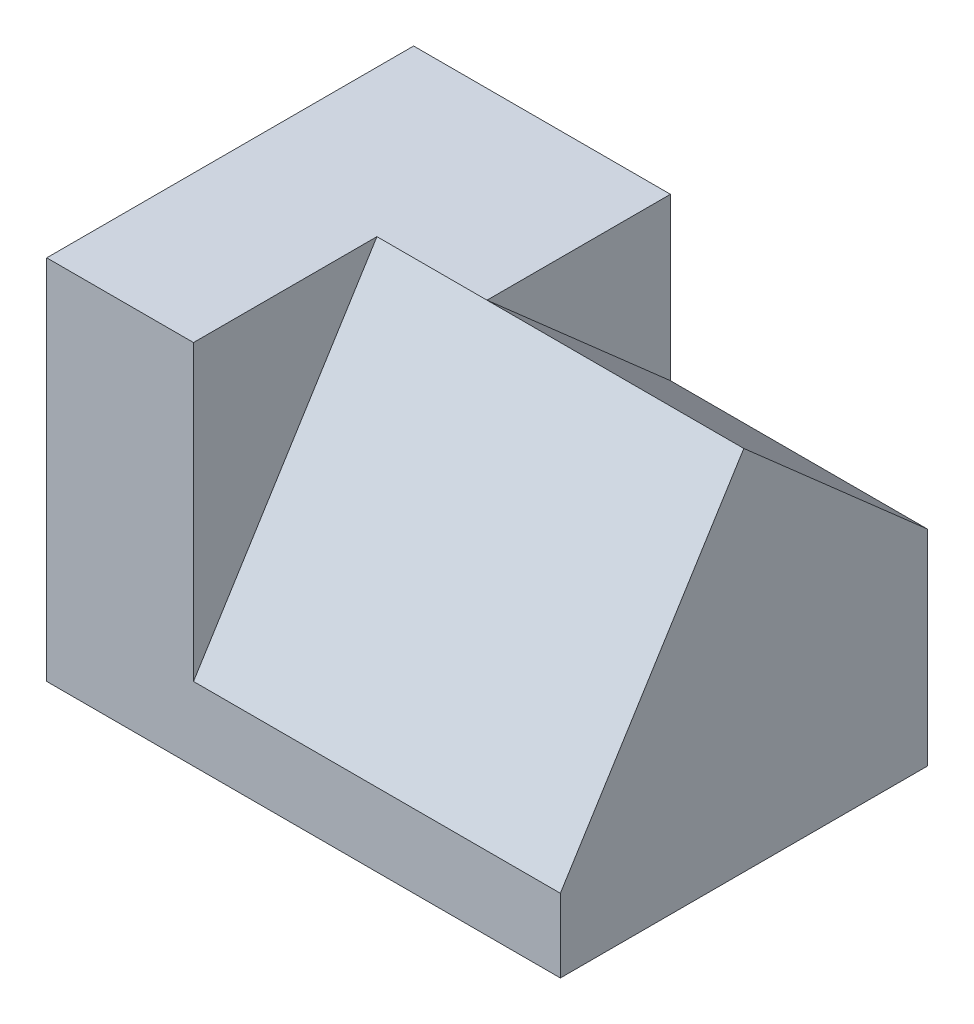
ISO-10303-21;
HEADER;
FILE_DESCRIPTION(('STEP AP214'),'2;1');
FILE_NAME('part.step','',(''),(''),'','','');
FILE_SCHEMA(('AUTOMOTIVE_DESIGN { 1 0 10303 214 1 1 1 1 }'));
ENDSEC;
DATA;
#1=APPLICATION_CONTEXT('core data for automotive mechanical design processes');
#2=APPLICATION_PROTOCOL_DEFINITION('international standard','automotive_design',2000,#1);
#3=PRODUCT_CONTEXT('',#1,'mechanical');
#4=PRODUCT('Part','Part','',(#3));
#5=PRODUCT_RELATED_PRODUCT_CATEGORY('part','',(#4));
#6=PRODUCT_DEFINITION_FORMATION('','',#4);
#7=PRODUCT_DEFINITION_CONTEXT('part definition',#1,'design');
#8=PRODUCT_DEFINITION('design','',#6,#7);
#9=PRODUCT_DEFINITION_SHAPE('','',#8);
#10=(LENGTH_UNIT() NAMED_UNIT(*) SI_UNIT(.MILLI.,.METRE.));
#11=(NAMED_UNIT(*) PLANE_ANGLE_UNIT() SI_UNIT($,.RADIAN.));
#12=(NAMED_UNIT(*) SI_UNIT($,.STERADIAN.) SOLID_ANGLE_UNIT());
#13=UNCERTAINTY_MEASURE_WITH_UNIT(LENGTH_MEASURE(1.E-05),#10,'distance_accuracy_value','');
#14=(GEOMETRIC_REPRESENTATION_CONTEXT(3) GLOBAL_UNCERTAINTY_ASSIGNED_CONTEXT((#13)) GLOBAL_UNIT_ASSIGNED_CONTEXT((#10,
#11,#12)) REPRESENTATION_CONTEXT('',''));
#15=CARTESIAN_POINT('',(0.,0.,0.));
#16=DIRECTION('',(0.,0.,1.));
#17=DIRECTION('',(1.,0.,0.));
#18=AXIS2_PLACEMENT_3D('',#15,#16,#17);
#19=CARTESIAN_POINT('',(35.,10.,-25.));
#20=DIRECTION('',(-1.,0.,0.));
#21=DIRECTION('',(0.,0.,1.));
#22=AXIS2_PLACEMENT_3D('',#19,#20,#21);
#23=PLANE('',#22);
#24=DIRECTION('',(0.,0.,-1.));
#25=VECTOR('',#24,1.);
#26=CARTESIAN_POINT('',(35.,0.,-25.));
#27=LINE('',#26,#25);
#28=CARTESIAN_POINT('',(35.,0.,25.));
#29=VERTEX_POINT('',#28);
#30=CARTESIAN_POINT('',(35.,0.,-25.));
#31=VERTEX_POINT('',#30);
#32=EDGE_CURVE('E118',#29,#31,#27,.T.);
#33=ORIENTED_EDGE('',*,*,#32,.T.);
#34=DIRECTION('',(0.,-1.,0.));
#35=VECTOR('',#34,1.);
#36=CARTESIAN_POINT('',(35.,10.,-25.));
#37=LINE('',#36,#35);
#38=CARTESIAN_POINT('',(35.,28.,-25.));
#39=VERTEX_POINT('',#38);
#40=EDGE_CURVE('E11',#39,#31,#37,.T.);
#41=ORIENTED_EDGE('',*,*,#40,.F.);
#42=DIRECTION('',(0.,0.660627894892025,0.750713516922755));
#43=VECTOR('',#42,1.);
#44=CARTESIAN_POINT('',(35.,28.,-25.));
#45=LINE('',#44,#43);
#46=CARTESIAN_POINT('',(35.,50.,0.));
#47=VERTEX_POINT('',#46);
#48=EDGE_CURVE('E108',#39,#47,#45,.T.);
#49=ORIENTED_EDGE('',*,*,#48,.T.);
#50=DIRECTION('',(0.,-0.847998304005088,0.52999894000318));
#51=VECTOR('',#50,1.);
#52=CARTESIAN_POINT('',(35.,50.,0.));
#53=LINE('',#52,#51);
#54=CARTESIAN_POINT('',(35.,10.,25.));
#55=VERTEX_POINT('',#54);
#56=EDGE_CURVE('E147',#47,#55,#53,.T.);
#57=ORIENTED_EDGE('',*,*,#56,.T.);
#58=DIRECTION('',(0.,-1.,0.));
#59=VECTOR('',#58,1.);
#60=CARTESIAN_POINT('',(35.,10.,25.));
#61=LINE('',#60,#59);
#62=EDGE_CURVE('E114',#55,#29,#61,.T.);
#63=ORIENTED_EDGE('',*,*,#62,.T.);
#64=EDGE_LOOP('',(#33,#41,#49,#57,#63));
#65=FACE_BOUND('',#64,.T.);
#66=ADVANCED_FACE('F33',(#65),#23,.F.);
#67=CARTESIAN_POINT('',(-35.,10.,-25.));
#68=DIRECTION('',(0.,0.,1.));
#69=DIRECTION('',(1.,0.,0.));
#70=AXIS2_PLACEMENT_3D('',#67,#68,#69);
#71=PLANE('',#70);
#72=DIRECTION('',(0.,-1.,0.));
#73=VECTOR('',#72,1.);
#74=CARTESIAN_POINT('',(0.,50.,-25.));
#75=LINE('',#74,#73);
#76=CARTESIAN_POINT('',(0.,50.,-25.));
#77=VERTEX_POINT('',#76);
#78=CARTESIAN_POINT('',(0.,28.,-25.));
#79=VERTEX_POINT('',#78);
#80=EDGE_CURVE('E119',#77,#79,#75,.T.);
#81=ORIENTED_EDGE('',*,*,#80,.T.);
#82=DIRECTION('',(1.,0.,0.));
#83=VECTOR('',#82,1.);
#84=CARTESIAN_POINT('',(-15.,28.,-25.));
#85=LINE('',#84,#83);
#86=EDGE_CURVE('E107',#79,#39,#85,.T.);
#87=ORIENTED_EDGE('',*,*,#86,.T.);
#88=ORIENTED_EDGE('',*,*,#40,.T.);
#89=DIRECTION('',(-1.,0.,0.));
#90=VECTOR('',#89,1.);
#91=CARTESIAN_POINT('',(-35.,0.,-25.));
#92=LINE('',#91,#90);
#93=CARTESIAN_POINT('',(-35.,0.,-25.));
#94=VERTEX_POINT('',#93);
#95=EDGE_CURVE('E122',#31,#94,#92,.T.);
#96=ORIENTED_EDGE('',*,*,#95,.T.);
#97=DIRECTION('',(0.,-1.,0.));
#98=VECTOR('',#97,1.);
#99=CARTESIAN_POINT('',(-35.,10.,-25.));
#100=LINE('',#99,#98);
#101=CARTESIAN_POINT('',(-35.,50.,-25.));
#102=VERTEX_POINT('',#101);
#103=EDGE_CURVE('E40',#102,#94,#100,.T.);
#104=ORIENTED_EDGE('',*,*,#103,.F.);
#105=DIRECTION('',(-1.,0.,0.));
#106=VECTOR('',#105,1.);
#107=CARTESIAN_POINT('',(-35.,50.,-25.));
#108=LINE('',#107,#106);
#109=EDGE_CURVE('E125',#77,#102,#108,.T.);
#110=ORIENTED_EDGE('',*,*,#109,.F.);
#111=EDGE_LOOP('',(#81,#87,#88,#96,#104,#110));
#112=FACE_BOUND('',#111,.T.);
#113=ADVANCED_FACE('F168',(#112),#71,.F.);
#114=CARTESIAN_POINT('',(-35.,10.,-25.));
#115=DIRECTION('',(1.,0.,0.));
#116=DIRECTION('',(0.,0.,-1.));
#117=AXIS2_PLACEMENT_3D('',#114,#115,#116);
#118=PLANE('',#117);
#119=DIRECTION('',(0.,0.,1.));
#120=VECTOR('',#119,1.);
#121=CARTESIAN_POINT('',(-35.,0.,-25.));
#122=LINE('',#121,#120);
#123=CARTESIAN_POINT('',(-35.,0.,25.));
#124=VERTEX_POINT('',#123);
#125=EDGE_CURVE('E55',#94,#124,#122,.T.);
#126=ORIENTED_EDGE('',*,*,#125,.T.);
#127=DIRECTION('',(0.,-1.,0.));
#128=VECTOR('',#127,1.);
#129=CARTESIAN_POINT('',(-35.,10.,25.));
#130=LINE('',#129,#128);
#131=CARTESIAN_POINT('',(-35.,50.,25.));
#132=VERTEX_POINT('',#131);
#133=EDGE_CURVE('E133',#132,#124,#130,.T.);
#134=ORIENTED_EDGE('',*,*,#133,.F.);
#135=DIRECTION('',(0.,0.,1.));
#136=VECTOR('',#135,1.);
#137=CARTESIAN_POINT('',(-35.,50.,25.));
#138=LINE('',#137,#136);
#139=EDGE_CURVE('E137',#102,#132,#138,.T.);
#140=ORIENTED_EDGE('',*,*,#139,.F.);
#141=ORIENTED_EDGE('',*,*,#103,.T.);
#142=EDGE_LOOP('',(#126,#134,#140,#141));
#143=FACE_BOUND('',#142,.T.);
#144=ADVANCED_FACE('F135',(#143),#118,.F.);
#145=CARTESIAN_POINT('',(-35.,10.,25.));
#146=DIRECTION('',(0.,0.,-1.));
#147=DIRECTION('',(-1.,0.,0.));
#148=AXIS2_PLACEMENT_3D('',#145,#146,#147);
#149=PLANE('',#148);
#150=DIRECTION('',(1.,0.,0.));
#151=VECTOR('',#150,1.);
#152=CARTESIAN_POINT('',(-35.,0.,25.));
#153=LINE('',#152,#151);
#154=EDGE_CURVE('E47',#124,#29,#153,.T.);
#155=ORIENTED_EDGE('',*,*,#154,.T.);
#156=ORIENTED_EDGE('',*,*,#62,.F.);
#157=DIRECTION('',(1.,0.,0.));
#158=VECTOR('',#157,1.);
#159=CARTESIAN_POINT('',(-35.,10.,25.));
#160=LINE('',#159,#158);
#161=CARTESIAN_POINT('',(-15.,10.,25.));
#162=VERTEX_POINT('',#161);
#163=EDGE_CURVE('E99',#162,#55,#160,.T.);
#164=ORIENTED_EDGE('',*,*,#163,.F.);
#165=DIRECTION('',(0.,-1.,0.));
#166=VECTOR('',#165,1.);
#167=CARTESIAN_POINT('',(-15.,50.,25.));
#168=LINE('',#167,#166);
#169=CARTESIAN_POINT('',(-15.,50.,25.));
#170=VERTEX_POINT('',#169);
#171=EDGE_CURVE('E113',#170,#162,#168,.T.);
#172=ORIENTED_EDGE('',*,*,#171,.F.);
#173=DIRECTION('',(1.,0.,0.));
#174=VECTOR('',#173,1.);
#175=CARTESIAN_POINT('',(-15.,50.,25.));
#176=LINE('',#175,#174);
#177=EDGE_CURVE('E159',#132,#170,#176,.T.);
#178=ORIENTED_EDGE('',*,*,#177,.F.);
#179=ORIENTED_EDGE('',*,*,#133,.T.);
#180=EDGE_LOOP('',(#155,#156,#164,#172,#178,#179));
#181=FACE_BOUND('',#180,.T.);
#182=ADVANCED_FACE('F111',(#181),#149,.F.);
#183=CARTESIAN_POINT('',(0.,0.,0.));
#184=DIRECTION('',(0.,1.,0.));
#185=DIRECTION('',(0.,0.,1.));
#186=AXIS2_PLACEMENT_3D('',#183,#184,#185);
#187=PLANE('',#186);
#188=ORIENTED_EDGE('',*,*,#32,.F.);
#189=ORIENTED_EDGE('',*,*,#154,.F.);
#190=ORIENTED_EDGE('',*,*,#125,.F.);
#191=ORIENTED_EDGE('',*,*,#95,.F.);
#192=EDGE_LOOP('',(#188,#189,#190,#191));
#193=FACE_BOUND('',#192,.T.);
#194=ADVANCED_FACE('F143',(#193),#187,.F.);
#195=CARTESIAN_POINT('',(-15.,50.,0.));
#196=DIRECTION('',(-1.,0.,0.));
#197=DIRECTION('',(0.,0.,1.));
#198=AXIS2_PLACEMENT_3D('',#195,#196,#197);
#199=PLANE('',#198);
#200=ORIENTED_EDGE('',*,*,#171,.T.);
#201=DIRECTION('',(0.,-0.847998304005088,0.52999894000318));
#202=VECTOR('',#201,1.);
#203=CARTESIAN_POINT('',(-15.,50.,0.));
#204=LINE('',#203,#202);
#205=CARTESIAN_POINT('',(-15.,50.,0.));
#206=VERTEX_POINT('',#205);
#207=EDGE_CURVE('E95',#206,#162,#204,.T.);
#208=ORIENTED_EDGE('',*,*,#207,.F.);
#209=DIRECTION('',(0.,0.,-1.));
#210=VECTOR('',#209,1.);
#211=CARTESIAN_POINT('',(-15.,50.,0.));
#212=LINE('',#211,#210);
#213=EDGE_CURVE('E117',#170,#206,#212,.T.);
#214=ORIENTED_EDGE('',*,*,#213,.F.);
#215=EDGE_LOOP('',(#200,#208,#214));
#216=FACE_BOUND('',#215,.T.);
#217=ADVANCED_FACE('F116',(#216),#199,.F.);
#218=CARTESIAN_POINT('',(0.,50.,-25.));
#219=DIRECTION('',(-1.,0.,0.));
#220=DIRECTION('',(0.,0.,1.));
#221=AXIS2_PLACEMENT_3D('',#218,#219,#220);
#222=PLANE('',#221);
#223=DIRECTION('',(0.,0.,-1.));
#224=VECTOR('',#223,1.);
#225=CARTESIAN_POINT('',(0.,50.,-25.));
#226=LINE('',#225,#224);
#227=CARTESIAN_POINT('',(0.,50.,0.));
#228=VERTEX_POINT('',#227);
#229=EDGE_CURVE('E163',#228,#77,#226,.T.);
#230=ORIENTED_EDGE('',*,*,#229,.F.);
#231=DIRECTION('',(0.,-0.660627894892025,-0.750713516922755));
#232=VECTOR('',#231,1.);
#233=CARTESIAN_POINT('',(0.,37.6014427412083,-14.0892696122633));
#234=LINE('',#233,#232);
#235=EDGE_CURVE('E154',#228,#79,#234,.T.);
#236=ORIENTED_EDGE('',*,*,#235,.T.);
#237=ORIENTED_EDGE('',*,*,#80,.F.);
#238=EDGE_LOOP('',(#230,#236,#237));
#239=FACE_BOUND('',#238,.T.);
#240=ADVANCED_FACE('F170',(#239),#222,.F.);
#241=CARTESIAN_POINT('',(0.,50.,0.));
#242=DIRECTION('',(0.,-1.,0.));
#243=DIRECTION('',(0.,0.,-1.));
#244=AXIS2_PLACEMENT_3D('',#241,#242,#243);
#245=PLANE('',#244);
#246=ORIENTED_EDGE('',*,*,#139,.T.);
#247=ORIENTED_EDGE('',*,*,#177,.T.);
#248=ORIENTED_EDGE('',*,*,#213,.T.);
#249=DIRECTION('',(1.,0.,0.));
#250=VECTOR('',#249,1.);
#251=CARTESIAN_POINT('',(0.,50.,0.));
#252=LINE('',#251,#250);
#253=EDGE_CURVE('E102',#206,#228,#252,.T.);
#254=ORIENTED_EDGE('',*,*,#253,.T.);
#255=ORIENTED_EDGE('',*,*,#229,.T.);
#256=ORIENTED_EDGE('',*,*,#109,.T.);
#257=EDGE_LOOP('',(#246,#247,#248,#254,#255,#256));
#258=FACE_BOUND('',#257,.T.);
#259=ADVANCED_FACE('F165',(#258),#245,.F.);
#260=CARTESIAN_POINT('',(-15.,28.,-25.));
#261=DIRECTION('',(0.,0.750713516922755,-0.660627894892025));
#262=DIRECTION('',(0.,0.660627894892025,0.750713516922755));
#263=AXIS2_PLACEMENT_3D('',#260,#261,#262);
#264=PLANE('',#263);
#265=ORIENTED_EDGE('',*,*,#235,.F.);
#266=DIRECTION('',(1.,0.,0.));
#267=VECTOR('',#266,1.);
#268=CARTESIAN_POINT('',(-15.,50.,0.));
#269=LINE('',#268,#267);
#270=EDGE_CURVE('E152',#228,#47,#269,.T.);
#271=ORIENTED_EDGE('',*,*,#270,.T.);
#272=ORIENTED_EDGE('',*,*,#48,.F.);
#273=ORIENTED_EDGE('',*,*,#86,.F.);
#274=EDGE_LOOP('',(#265,#271,#272,#273));
#275=FACE_BOUND('',#274,.T.);
#276=ADVANCED_FACE('F173',(#275),#264,.T.);
#277=CARTESIAN_POINT('',(-15.,50.,0.));
#278=DIRECTION('',(0.,0.52999894000318,0.847998304005088));
#279=DIRECTION('',(0.,-0.847998304005088,0.52999894000318));
#280=AXIS2_PLACEMENT_3D('',#277,#278,#279);
#281=PLANE('',#280);
#282=ORIENTED_EDGE('',*,*,#56,.F.);
#283=ORIENTED_EDGE('',*,*,#270,.F.);
#284=ORIENTED_EDGE('',*,*,#253,.F.);
#285=ORIENTED_EDGE('',*,*,#207,.T.);
#286=ORIENTED_EDGE('',*,*,#163,.T.);
#287=EDGE_LOOP('',(#282,#283,#284,#285,#286));
#288=FACE_BOUND('',#287,.T.);
#289=ADVANCED_FACE('F98',(#288),#281,.T.);
#290=CLOSED_SHELL('',(#66,#113,#144,#182,#194,#217,#240,#259,#276,#289));
#291=MANIFOLD_SOLID_BREP('B2',#290);
#292=ADVANCED_BREP_SHAPE_REPRESENTATION('',(#18,#291),#14);
#293=SHAPE_DEFINITION_REPRESENTATION(#9,#292);
ENDSEC;
END-ISO-10303-21;
